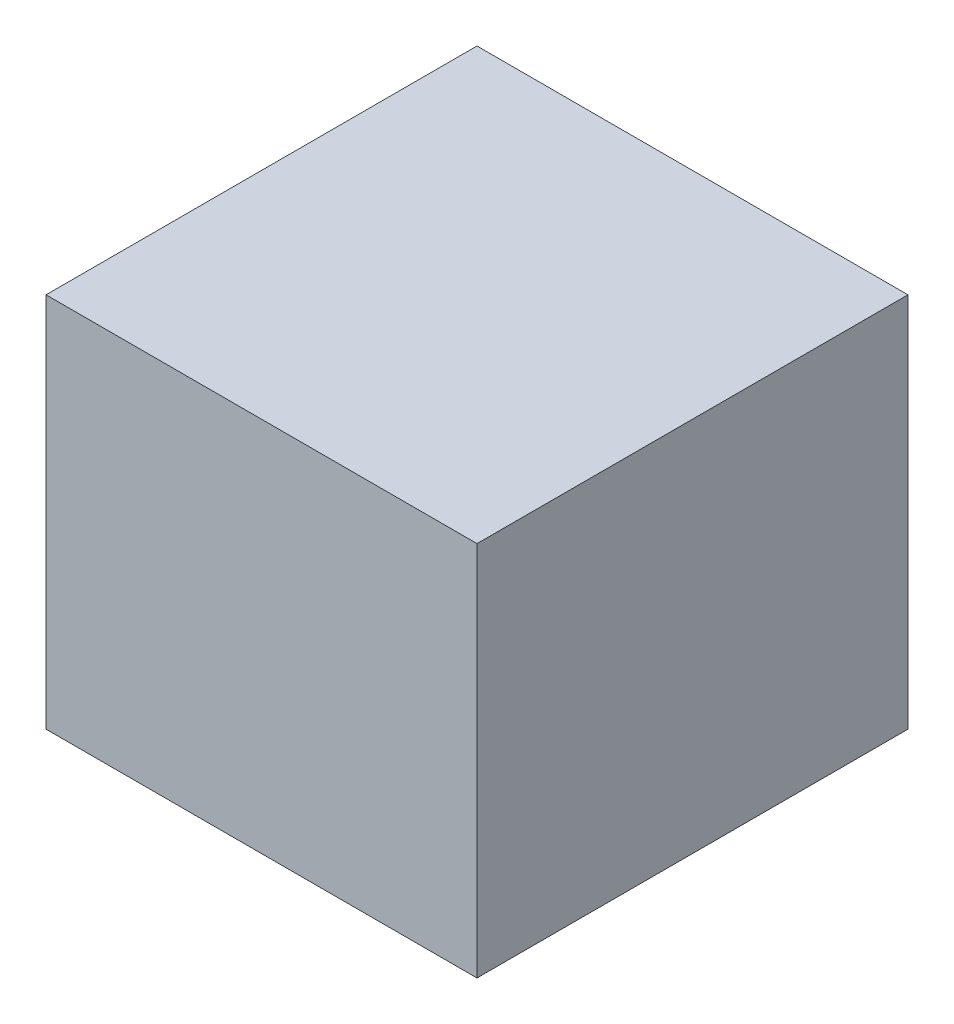
ISO-10303-21;
HEADER;
FILE_DESCRIPTION(('STEP AP214'),'2;1');
FILE_NAME('part.step','',(''),(''),'','','');
FILE_SCHEMA(('AUTOMOTIVE_DESIGN { 1 0 10303 214 1 1 1 1 }'));
ENDSEC;
DATA;
#1=APPLICATION_CONTEXT('core data for automotive mechanical design processes');
#2=APPLICATION_PROTOCOL_DEFINITION('international standard','automotive_design',2000,#1);
#3=PRODUCT_CONTEXT('',#1,'mechanical');
#4=PRODUCT('Part','Part','',(#3));
#5=PRODUCT_RELATED_PRODUCT_CATEGORY('part','',(#4));
#6=PRODUCT_DEFINITION_FORMATION('','',#4);
#7=PRODUCT_DEFINITION_CONTEXT('part definition',#1,'design');
#8=PRODUCT_DEFINITION('design','',#6,#7);
#9=PRODUCT_DEFINITION_SHAPE('','',#8);
#10=(LENGTH_UNIT() NAMED_UNIT(*) SI_UNIT(.MILLI.,.METRE.));
#11=(NAMED_UNIT(*) PLANE_ANGLE_UNIT() SI_UNIT($,.RADIAN.));
#12=(NAMED_UNIT(*) SI_UNIT($,.STERADIAN.) SOLID_ANGLE_UNIT());
#13=UNCERTAINTY_MEASURE_WITH_UNIT(LENGTH_MEASURE(1.E-05),#10,'distance_accuracy_value','');
#14=(GEOMETRIC_REPRESENTATION_CONTEXT(3) GLOBAL_UNCERTAINTY_ASSIGNED_CONTEXT((#13)) GLOBAL_UNIT_ASSIGNED_CONTEXT((#10,
#11,#12)) REPRESENTATION_CONTEXT('',''));
#15=CARTESIAN_POINT('',(0.,0.,0.));
#16=DIRECTION('',(0.,0.,1.));
#17=DIRECTION('',(1.,0.,0.));
#18=AXIS2_PLACEMENT_3D('',#15,#16,#17);
#19=CARTESIAN_POINT('',(91.948,160.528,91.948));
#20=DIRECTION('',(-1.,0.,0.));
#21=DIRECTION('',(0.,0.,1.));
#22=AXIS2_PLACEMENT_3D('',#19,#20,#21);
#23=PLANE('',#22);
#24=DIRECTION('',(0.,0.,-1.));
#25=VECTOR('',#24,1.);
#26=CARTESIAN_POINT('',(91.948,0.,91.948));
#27=LINE('',#26,#25);
#28=CARTESIAN_POINT('',(91.948,0.,91.948));
#29=VERTEX_POINT('',#28);
#30=CARTESIAN_POINT('',(91.948,0.,-91.948));
#31=VERTEX_POINT('',#30);
#32=EDGE_CURVE('E96',#29,#31,#27,.T.);
#33=ORIENTED_EDGE('',*,*,#32,.T.);
#34=DIRECTION('',(0.,-1.,0.));
#35=VECTOR('',#34,1.);
#36=CARTESIAN_POINT('',(91.948,160.528,-91.948));
#37=LINE('',#36,#35);
#38=CARTESIAN_POINT('',(91.948,160.528,-91.948));
#39=VERTEX_POINT('',#38);
#40=EDGE_CURVE('E11',#39,#31,#37,.T.);
#41=ORIENTED_EDGE('',*,*,#40,.F.);
#42=DIRECTION('',(0.,0.,-1.));
#43=VECTOR('',#42,1.);
#44=CARTESIAN_POINT('',(91.948,160.528,91.948));
#45=LINE('',#44,#43);
#46=CARTESIAN_POINT('',(91.948,160.528,91.948));
#47=VERTEX_POINT('',#46);
#48=EDGE_CURVE('E84',#47,#39,#45,.T.);
#49=ORIENTED_EDGE('',*,*,#48,.F.);
#50=DIRECTION('',(0.,-1.,0.));
#51=VECTOR('',#50,1.);
#52=CARTESIAN_POINT('',(91.948,160.528,91.948));
#53=LINE('',#52,#51);
#54=EDGE_CURVE('E92',#47,#29,#53,.T.);
#55=ORIENTED_EDGE('',*,*,#54,.T.);
#56=EDGE_LOOP('',(#33,#41,#49,#55));
#57=FACE_BOUND('',#56,.T.);
#58=ADVANCED_FACE('F33',(#57),#23,.F.);
#59=CARTESIAN_POINT('',(-91.948,160.528,-91.948));
#60=DIRECTION('',(0.,0.,1.));
#61=DIRECTION('',(1.,0.,0.));
#62=AXIS2_PLACEMENT_3D('',#59,#60,#61);
#63=PLANE('',#62);
#64=DIRECTION('',(-1.,0.,0.));
#65=VECTOR('',#64,1.);
#66=CARTESIAN_POINT('',(-91.948,0.,-91.948));
#67=LINE('',#66,#65);
#68=CARTESIAN_POINT('',(-91.948,0.,-91.948));
#69=VERTEX_POINT('',#68);
#70=EDGE_CURVE('E88',#31,#69,#67,.T.);
#71=ORIENTED_EDGE('',*,*,#70,.T.);
#72=DIRECTION('',(0.,-1.,0.));
#73=VECTOR('',#72,1.);
#74=CARTESIAN_POINT('',(-91.948,160.528,-91.948));
#75=LINE('',#74,#73);
#76=CARTESIAN_POINT('',(-91.948,160.528,-91.948));
#77=VERTEX_POINT('',#76);
#78=EDGE_CURVE('E41',#77,#69,#75,.T.);
#79=ORIENTED_EDGE('',*,*,#78,.F.);
#80=DIRECTION('',(-1.,0.,0.));
#81=VECTOR('',#80,1.);
#82=CARTESIAN_POINT('',(-91.948,160.528,-91.948));
#83=LINE('',#82,#81);
#84=EDGE_CURVE('E79',#39,#77,#83,.T.);
#85=ORIENTED_EDGE('',*,*,#84,.F.);
#86=ORIENTED_EDGE('',*,*,#40,.T.);
#87=EDGE_LOOP('',(#71,#79,#85,#86));
#88=FACE_BOUND('',#87,.T.);
#89=ADVANCED_FACE('F87',(#88),#63,.F.);
#90=CARTESIAN_POINT('',(-91.948,160.528,91.948));
#91=DIRECTION('',(1.,0.,0.));
#92=DIRECTION('',(0.,0.,-1.));
#93=AXIS2_PLACEMENT_3D('',#90,#91,#92);
#94=PLANE('',#93);
#95=DIRECTION('',(0.,0.,1.));
#96=VECTOR('',#95,1.);
#97=CARTESIAN_POINT('',(-91.948,0.,91.948));
#98=LINE('',#97,#96);
#99=CARTESIAN_POINT('',(-91.948,0.,91.948));
#100=VERTEX_POINT('',#99);
#101=EDGE_CURVE('E66',#69,#100,#98,.T.);
#102=ORIENTED_EDGE('',*,*,#101,.T.);
#103=DIRECTION('',(0.,-1.,0.));
#104=VECTOR('',#103,1.);
#105=CARTESIAN_POINT('',(-91.948,160.528,91.948));
#106=LINE('',#105,#104);
#107=CARTESIAN_POINT('',(-91.948,160.528,91.948));
#108=VERTEX_POINT('',#107);
#109=EDGE_CURVE('E89',#108,#100,#106,.T.);
#110=ORIENTED_EDGE('',*,*,#109,.F.);
#111=DIRECTION('',(0.,0.,1.));
#112=VECTOR('',#111,1.);
#113=CARTESIAN_POINT('',(-91.948,160.528,91.948));
#114=LINE('',#113,#112);
#115=EDGE_CURVE('E82',#77,#108,#114,.T.);
#116=ORIENTED_EDGE('',*,*,#115,.F.);
#117=ORIENTED_EDGE('',*,*,#78,.T.);
#118=EDGE_LOOP('',(#102,#110,#116,#117));
#119=FACE_BOUND('',#118,.T.);
#120=ADVANCED_FACE('F90',(#119),#94,.F.);
#121=CARTESIAN_POINT('',(-91.948,160.528,91.948));
#122=DIRECTION('',(0.,0.,-1.));
#123=DIRECTION('',(-1.,0.,0.));
#124=AXIS2_PLACEMENT_3D('',#121,#122,#123);
#125=PLANE('',#124);
#126=DIRECTION('',(1.,0.,0.));
#127=VECTOR('',#126,1.);
#128=CARTESIAN_POINT('',(-91.948,0.,91.948));
#129=LINE('',#128,#127);
#130=EDGE_CURVE('E72',#100,#29,#129,.T.);
#131=ORIENTED_EDGE('',*,*,#130,.T.);
#132=ORIENTED_EDGE('',*,*,#54,.F.);
#133=DIRECTION('',(1.,0.,0.));
#134=VECTOR('',#133,1.);
#135=CARTESIAN_POINT('',(-91.948,160.528,91.948));
#136=LINE('',#135,#134);
#137=EDGE_CURVE('E49',#108,#47,#136,.T.);
#138=ORIENTED_EDGE('',*,*,#137,.F.);
#139=ORIENTED_EDGE('',*,*,#109,.T.);
#140=EDGE_LOOP('',(#131,#132,#138,#139));
#141=FACE_BOUND('',#140,.T.);
#142=ADVANCED_FACE('F103',(#141),#125,.F.);
#143=CARTESIAN_POINT('',(0.,160.528,0.));
#144=DIRECTION('',(0.,-1.,0.));
#145=DIRECTION('',(0.,0.,-1.));
#146=AXIS2_PLACEMENT_3D('',#143,#144,#145);
#147=PLANE('',#146);
#148=ORIENTED_EDGE('',*,*,#48,.T.);
#149=ORIENTED_EDGE('',*,*,#84,.T.);
#150=ORIENTED_EDGE('',*,*,#115,.T.);
#151=ORIENTED_EDGE('',*,*,#137,.T.);
#152=EDGE_LOOP('',(#148,#149,#150,#151));
#153=FACE_BOUND('',#152,.T.);
#154=ADVANCED_FACE('F80',(#153),#147,.F.);
#155=CARTESIAN_POINT('',(0.,0.,0.));
#156=DIRECTION('',(0.,-1.,0.));
#157=DIRECTION('',(0.,0.,-1.));
#158=AXIS2_PLACEMENT_3D('',#155,#156,#157);
#159=PLANE('',#158);
#160=ORIENTED_EDGE('',*,*,#32,.F.);
#161=ORIENTED_EDGE('',*,*,#130,.F.);
#162=ORIENTED_EDGE('',*,*,#101,.F.);
#163=ORIENTED_EDGE('',*,*,#70,.F.);
#164=EDGE_LOOP('',(#160,#161,#162,#163));
#165=FACE_BOUND('',#164,.T.);
#166=ADVANCED_FACE('F106',(#165),#159,.T.);
#167=CLOSED_SHELL('',(#58,#89,#120,#142,#154,#166));
#168=MANIFOLD_SOLID_BREP('B2',#167);
#169=ADVANCED_BREP_SHAPE_REPRESENTATION('',(#18,#168),#14);
#170=SHAPE_DEFINITION_REPRESENTATION(#9,#169);
ENDSEC;
END-ISO-10303-21;
